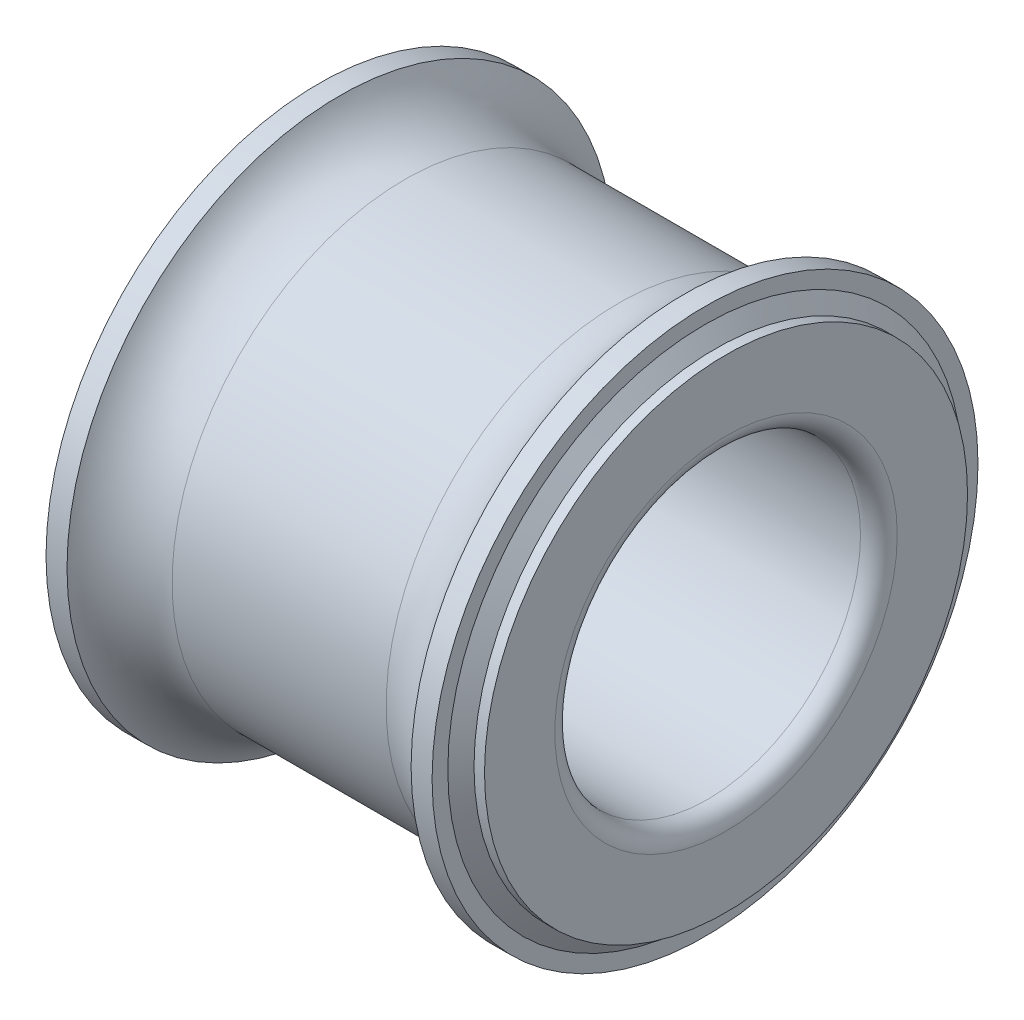
ISO-10303-21;
HEADER;
FILE_DESCRIPTION(('STEP AP214'),'2;1');
FILE_NAME('part.step','',(''),(''),'','','');
FILE_SCHEMA(('AUTOMOTIVE_DESIGN { 1 0 10303 214 1 1 1 1 }'));
ENDSEC;
DATA;
#1=APPLICATION_CONTEXT('core data for automotive mechanical design processes');
#2=APPLICATION_PROTOCOL_DEFINITION('international standard','automotive_design',2000,#1);
#3=PRODUCT_CONTEXT('',#1,'mechanical');
#4=PRODUCT('Part','Part','',(#3));
#5=PRODUCT_RELATED_PRODUCT_CATEGORY('part','',(#4));
#6=PRODUCT_DEFINITION_FORMATION('','',#4);
#7=PRODUCT_DEFINITION_CONTEXT('part definition',#1,'design');
#8=PRODUCT_DEFINITION('design','',#6,#7);
#9=PRODUCT_DEFINITION_SHAPE('','',#8);
#10=(LENGTH_UNIT() NAMED_UNIT(*) SI_UNIT(.MILLI.,.METRE.));
#11=(NAMED_UNIT(*) PLANE_ANGLE_UNIT() SI_UNIT($,.RADIAN.));
#12=(NAMED_UNIT(*) SI_UNIT($,.STERADIAN.) SOLID_ANGLE_UNIT());
#13=UNCERTAINTY_MEASURE_WITH_UNIT(LENGTH_MEASURE(1.E-05),#10,'distance_accuracy_value','');
#14=(GEOMETRIC_REPRESENTATION_CONTEXT(3) GLOBAL_UNCERTAINTY_ASSIGNED_CONTEXT((#13)) GLOBAL_UNIT_ASSIGNED_CONTEXT((#10,
#11,#12)) REPRESENTATION_CONTEXT('',''));
#15=CARTESIAN_POINT('',(0.,0.,0.));
#16=DIRECTION('',(0.,0.,1.));
#17=DIRECTION('',(1.,0.,0.));
#18=AXIS2_PLACEMENT_3D('',#15,#16,#17);
#19=CARTESIAN_POINT('',(13.4,0.,0.));
#20=DIRECTION('',(1.,0.,0.));
#21=DIRECTION('',(0.,0.,-1.));
#22=AXIS2_PLACEMENT_3D('',#19,#20,#21);
#23=CYLINDRICAL_SURFACE('',#22,8.928);
#24=CARTESIAN_POINT('',(12.627143624676,0.,0.));
#25=DIRECTION('',(1.,0.,0.));
#26=DIRECTION('',(0.,0.,-1.));
#27=AXIS2_PLACEMENT_3D('',#24,#25,#26);
#28=CIRCLE('',#27,8.928);
#29=CARTESIAN_POINT('',(12.627143624676,0.,-8.928));
#30=VERTEX_POINT('',#29);
#31=EDGE_CURVE('E44',#30,#30,#28,.T.);
#32=ORIENTED_EDGE('',*,*,#31,.T.);
#33=EDGE_LOOP('',(#32));
#34=FACE_BOUND('',#33,.T.);
#35=CARTESIAN_POINT('',(13.313571812338,0.,0.));
#36=DIRECTION('',(-1.,0.,0.));
#37=DIRECTION('',(0.,0.,1.));
#38=AXIS2_PLACEMENT_3D('',#35,#36,#37);
#39=CIRCLE('',#38,8.928);
#40=CARTESIAN_POINT('',(13.313571812338,0.,8.928));
#41=VERTEX_POINT('',#40);
#42=EDGE_CURVE('E73',#41,#41,#39,.T.);
#43=ORIENTED_EDGE('',*,*,#42,.T.);
#44=EDGE_LOOP('',(#43));
#45=FACE_BOUND('',#44,.T.);
#46=ADVANCED_FACE('F29',(#34,#45),#23,.T.);
#47=CARTESIAN_POINT('',(13.4,0.,0.));
#48=DIRECTION('',(1.,0.,0.));
#49=DIRECTION('',(0.,0.,-1.));
#50=AXIS2_PLACEMENT_3D('',#47,#48,#49);
#51=CYLINDRICAL_SURFACE('',#50,8.928);
#52=CARTESIAN_POINT('',(1.3728563753239,0.,0.));
#53=DIRECTION('',(1.,0.,0.));
#54=DIRECTION('',(0.,0.,-1.));
#55=AXIS2_PLACEMENT_3D('',#52,#53,#54);
#56=CIRCLE('',#55,8.928);
#57=CARTESIAN_POINT('',(1.3728563753239,0.,-8.928));
#58=VERTEX_POINT('',#57);
#59=EDGE_CURVE('E55',#58,#58,#56,.T.);
#60=ORIENTED_EDGE('',*,*,#59,.F.);
#61=EDGE_LOOP('',(#60));
#62=FACE_BOUND('',#61,.T.);
#63=CARTESIAN_POINT('',(0.68642818766197,0.,0.));
#64=DIRECTION('',(-1.,0.,0.));
#65=DIRECTION('',(0.,0.,1.));
#66=AXIS2_PLACEMENT_3D('',#63,#64,#65);
#67=CIRCLE('',#66,8.928);
#68=CARTESIAN_POINT('',(0.68642818766197,0.,8.928));
#69=VERTEX_POINT('',#68);
#70=EDGE_CURVE('E70',#69,#69,#67,.T.);
#71=ORIENTED_EDGE('',*,*,#70,.F.);
#72=EDGE_LOOP('',(#71));
#73=FACE_BOUND('',#72,.T.);
#74=ADVANCED_FACE('F104',(#62,#73),#51,.T.);
#75=CARTESIAN_POINT('',(10.4999999999993,0.,0.));
#76=DIRECTION('',(1.,0.,0.));
#77=DIRECTION('',(0.,0.,-1.));
#78=AXIS2_PLACEMENT_3D('',#75,#76,#77);
#79=TOROIDAL_SURFACE('',#78,10.0000000000011,2.38200000000109);
#80=CARTESIAN_POINT('',(10.5,0.,0.));
#81=DIRECTION('',(1.,0.,0.));
#82=DIRECTION('',(0.,0.,-1.));
#83=AXIS2_PLACEMENT_3D('',#80,#81,#82);
#84=CIRCLE('',#83,7.618);
#85=CARTESIAN_POINT('',(10.5,0.,-7.618));
#86=VERTEX_POINT('',#85);
#87=EDGE_CURVE('E49',#86,#86,#84,.T.);
#88=ORIENTED_EDGE('',*,*,#87,.T.);
#89=EDGE_LOOP('',(#88));
#90=FACE_BOUND('',#89,.T.);
#91=ORIENTED_EDGE('',*,*,#31,.F.);
#92=EDGE_LOOP('',(#91));
#93=FACE_BOUND('',#92,.T.);
#94=ADVANCED_FACE('F109',(#90,#93),#79,.F.);
#95=CARTESIAN_POINT('',(13.4,0.,0.));
#96=DIRECTION('',(1.,0.,0.));
#97=DIRECTION('',(0.,0.,-1.));
#98=AXIS2_PLACEMENT_3D('',#95,#96,#97);
#99=CYLINDRICAL_SURFACE('',#98,7.618);
#100=CARTESIAN_POINT('',(3.5,0.,0.));
#101=DIRECTION('',(1.,0.,0.));
#102=DIRECTION('',(0.,0.,-1.));
#103=AXIS2_PLACEMENT_3D('',#100,#101,#102);
#104=CIRCLE('',#103,7.618);
#105=CARTESIAN_POINT('',(3.5,0.,-7.618));
#106=VERTEX_POINT('',#105);
#107=EDGE_CURVE('E52',#106,#106,#104,.T.);
#108=ORIENTED_EDGE('',*,*,#107,.T.);
#109=EDGE_LOOP('',(#108));
#110=FACE_BOUND('',#109,.T.);
#111=ORIENTED_EDGE('',*,*,#87,.F.);
#112=EDGE_LOOP('',(#111));
#113=FACE_BOUND('',#112,.T.);
#114=ADVANCED_FACE('F116',(#110,#113),#99,.T.);
#115=CARTESIAN_POINT('',(3.50000000000006,0.,0.));
#116=DIRECTION('',(1.,0.,0.));
#117=DIRECTION('',(0.,0.,-1.));
#118=AXIS2_PLACEMENT_3D('',#115,#116,#117);
#119=TOROIDAL_SURFACE('',#118,10.0000000000002,2.38200000000017);
#120=ORIENTED_EDGE('',*,*,#59,.T.);
#121=EDGE_LOOP('',(#120));
#122=FACE_BOUND('',#121,.T.);
#123=ORIENTED_EDGE('',*,*,#107,.F.);
#124=EDGE_LOOP('',(#123));
#125=FACE_BOUND('',#124,.T.);
#126=ADVANCED_FACE('F120',(#122,#125),#119,.F.);
#127=CARTESIAN_POINT('',(0.68642818766197,8.414,0.));
#128=DIRECTION('',(-1.,0.,0.));
#129=DIRECTION('',(0.,0.,1.));
#130=AXIS2_PLACEMENT_3D('',#127,#128,#129);
#131=PLANE('',#130);
#132=ORIENTED_EDGE('',*,*,#70,.T.);
#133=EDGE_LOOP('',(#132));
#134=FACE_BOUND('',#133,.T.);
#135=CARTESIAN_POINT('',(0.68642818766197,0.,0.));
#136=DIRECTION('',(-1.,0.,0.));
#137=DIRECTION('',(0.,0.,1.));
#138=AXIS2_PLACEMENT_3D('',#135,#136,#137);
#139=CIRCLE('',#138,8.414);
#140=CARTESIAN_POINT('',(0.68642818766197,0.,8.414));
#141=VERTEX_POINT('',#140);
#142=EDGE_CURVE('E67',#141,#141,#139,.T.);
#143=ORIENTED_EDGE('',*,*,#142,.F.);
#144=EDGE_LOOP('',(#143));
#145=FACE_BOUND('',#144,.T.);
#146=ADVANCED_FACE('F123',(#134,#145),#131,.T.);
#147=CARTESIAN_POINT('',(0.34321409383099,0.,0.));
#148=DIRECTION('',(1.,0.,0.));
#149=DIRECTION('',(0.,0.,-1.));
#150=AXIS2_PLACEMENT_3D('',#147,#148,#149);
#151=CONICAL_SURFACE('',#150,7.9,0.982056754829537);
#152=ORIENTED_EDGE('',*,*,#142,.T.);
#153=EDGE_LOOP('',(#152));
#154=FACE_BOUND('',#153,.T.);
#155=CARTESIAN_POINT('',(0.34321409383099,0.,0.));
#156=DIRECTION('',(-1.,0.,0.));
#157=DIRECTION('',(0.,0.,1.));
#158=AXIS2_PLACEMENT_3D('',#155,#156,#157);
#159=CIRCLE('',#158,7.9);
#160=CARTESIAN_POINT('',(0.34321409383099,0.,7.9));
#161=VERTEX_POINT('',#160);
#162=EDGE_CURVE('E64',#161,#161,#159,.T.);
#163=ORIENTED_EDGE('',*,*,#162,.F.);
#164=EDGE_LOOP('',(#163));
#165=FACE_BOUND('',#164,.T.);
#166=ADVANCED_FACE('F134',(#154,#165),#151,.T.);
#167=CARTESIAN_POINT('',(14.,0.,0.));
#168=DIRECTION('',(-1.,0.,0.));
#169=DIRECTION('',(0.,0.,1.));
#170=AXIS2_PLACEMENT_3D('',#167,#168,#169);
#171=CYLINDRICAL_SURFACE('',#170,7.9);
#172=ORIENTED_EDGE('',*,*,#162,.T.);
#173=EDGE_LOOP('',(#172));
#174=FACE_BOUND('',#173,.T.);
#175=CARTESIAN_POINT('',(0.,0.,0.));
#176=DIRECTION('',(-1.,0.,0.));
#177=DIRECTION('',(0.,0.,1.));
#178=AXIS2_PLACEMENT_3D('',#175,#176,#177);
#179=CIRCLE('',#178,7.9);
#180=CARTESIAN_POINT('',(0.,0.,7.9));
#181=VERTEX_POINT('',#180);
#182=EDGE_CURVE('E61',#181,#181,#179,.T.);
#183=ORIENTED_EDGE('',*,*,#182,.F.);
#184=EDGE_LOOP('',(#183));
#185=FACE_BOUND('',#184,.T.);
#186=ADVANCED_FACE('F130',(#174,#185),#171,.T.);
#187=CARTESIAN_POINT('',(13.313571812338,8.928,0.));
#188=DIRECTION('',(1.,0.,0.));
#189=DIRECTION('',(0.,0.,-1.));
#190=AXIS2_PLACEMENT_3D('',#187,#188,#189);
#191=PLANE('',#190);
#192=CARTESIAN_POINT('',(13.313571812338,0.,0.));
#193=DIRECTION('',(-1.,0.,0.));
#194=DIRECTION('',(0.,0.,1.));
#195=AXIS2_PLACEMENT_3D('',#192,#193,#194);
#196=CIRCLE('',#195,8.414);
#197=CARTESIAN_POINT('',(13.313571812338,0.,8.414));
#198=VERTEX_POINT('',#197);
#199=EDGE_CURVE('E76',#198,#198,#196,.T.);
#200=ORIENTED_EDGE('',*,*,#199,.T.);
#201=EDGE_LOOP('',(#200));
#202=FACE_BOUND('',#201,.T.);
#203=ORIENTED_EDGE('',*,*,#42,.F.);
#204=EDGE_LOOP('',(#203));
#205=FACE_BOUND('',#204,.T.);
#206=ADVANCED_FACE('F133',(#202,#205),#191,.T.);
#207=CARTESIAN_POINT('',(13.313571812338,0.,0.));
#208=DIRECTION('',(-1.,0.,0.));
#209=DIRECTION('',(0.,0.,1.));
#210=AXIS2_PLACEMENT_3D('',#207,#208,#209);
#211=CONICAL_SURFACE('',#210,8.414,0.982056754829511);
#212=CARTESIAN_POINT('',(13.656785906169,0.,0.));
#213=DIRECTION('',(-1.,0.,0.));
#214=DIRECTION('',(0.,0.,1.));
#215=AXIS2_PLACEMENT_3D('',#212,#213,#214);
#216=CIRCLE('',#215,7.9);
#217=CARTESIAN_POINT('',(13.656785906169,0.,7.9));
#218=VERTEX_POINT('',#217);
#219=EDGE_CURVE('E79',#218,#218,#216,.T.);
#220=ORIENTED_EDGE('',*,*,#219,.T.);
#221=EDGE_LOOP('',(#220));
#222=FACE_BOUND('',#221,.T.);
#223=ORIENTED_EDGE('',*,*,#199,.F.);
#224=EDGE_LOOP('',(#223));
#225=FACE_BOUND('',#224,.T.);
#226=ADVANCED_FACE('F144',(#222,#225),#211,.T.);
#227=CARTESIAN_POINT('',(14.,0.,0.));
#228=DIRECTION('',(-1.,0.,0.));
#229=DIRECTION('',(0.,0.,1.));
#230=AXIS2_PLACEMENT_3D('',#227,#228,#229);
#231=CYLINDRICAL_SURFACE('',#230,7.9);
#232=CARTESIAN_POINT('',(14.,0.,0.));
#233=DIRECTION('',(-1.,0.,0.));
#234=DIRECTION('',(0.,0.,1.));
#235=AXIS2_PLACEMENT_3D('',#232,#233,#234);
#236=CIRCLE('',#235,7.9);
#237=CARTESIAN_POINT('',(14.,0.,7.9));
#238=VERTEX_POINT('',#237);
#239=EDGE_CURVE('E82',#238,#238,#236,.T.);
#240=ORIENTED_EDGE('',*,*,#239,.T.);
#241=EDGE_LOOP('',(#240));
#242=FACE_BOUND('',#241,.T.);
#243=ORIENTED_EDGE('',*,*,#219,.F.);
#244=EDGE_LOOP('',(#243));
#245=FACE_BOUND('',#244,.T.);
#246=ADVANCED_FACE('F86',(#242,#245),#231,.T.);
#247=CARTESIAN_POINT('',(13.4000000000001,0.,0.));
#248=DIRECTION('',(1.,0.,0.));
#249=DIRECTION('',(0.,0.,-1.));
#250=AXIS2_PLACEMENT_3D('',#247,#248,#249);
#251=TOROIDAL_SURFACE('',#250,5.59999999999993,0.599999999999929);
#252=CARTESIAN_POINT('',(14.,0.,0.));
#253=DIRECTION('',(1.,0.,0.));
#254=DIRECTION('',(0.,0.,-1.));
#255=AXIS2_PLACEMENT_3D('',#252,#253,#254);
#256=CIRCLE('',#255,5.6);
#257=CARTESIAN_POINT('',(14.,0.,-5.6));
#258=VERTEX_POINT('',#257);
#259=EDGE_CURVE('E40',#258,#258,#256,.T.);
#260=ORIENTED_EDGE('',*,*,#259,.T.);
#261=EDGE_LOOP('',(#260));
#262=FACE_BOUND('',#261,.T.);
#263=CARTESIAN_POINT('',(13.4,0.,0.));
#264=DIRECTION('',(1.,0.,0.));
#265=DIRECTION('',(0.,0.,-1.));
#266=AXIS2_PLACEMENT_3D('',#263,#264,#265);
#267=CIRCLE('',#266,5.);
#268=CARTESIAN_POINT('',(13.4,0.,-5.));
#269=VERTEX_POINT('',#268);
#270=EDGE_CURVE('E36',#269,#269,#267,.T.);
#271=ORIENTED_EDGE('',*,*,#270,.F.);
#272=EDGE_LOOP('',(#271));
#273=FACE_BOUND('',#272,.T.);
#274=ADVANCED_FACE('F92',(#262,#273),#251,.T.);
#275=CARTESIAN_POINT('',(14.,5.6,0.));
#276=DIRECTION('',(1.,0.,0.));
#277=DIRECTION('',(0.,0.,-1.));
#278=AXIS2_PLACEMENT_3D('',#275,#276,#277);
#279=PLANE('',#278);
#280=ORIENTED_EDGE('',*,*,#259,.F.);
#281=EDGE_LOOP('',(#280));
#282=FACE_BOUND('',#281,.T.);
#283=ORIENTED_EDGE('',*,*,#239,.F.);
#284=EDGE_LOOP('',(#283));
#285=FACE_BOUND('',#284,.T.);
#286=ADVANCED_FACE('F89',(#282,#285),#279,.T.);
#287=CARTESIAN_POINT('',(13.4,0.,0.));
#288=DIRECTION('',(1.,0.,0.));
#289=DIRECTION('',(0.,0.,-1.));
#290=AXIS2_PLACEMENT_3D('',#287,#288,#289);
#291=CYLINDRICAL_SURFACE('',#290,5.);
#292=ORIENTED_EDGE('',*,*,#270,.T.);
#293=EDGE_LOOP('',(#292));
#294=FACE_BOUND('',#293,.T.);
#295=CARTESIAN_POINT('',(0.6,0.,0.));
#296=DIRECTION('',(1.,0.,0.));
#297=DIRECTION('',(0.,0.,-1.));
#298=AXIS2_PLACEMENT_3D('',#295,#296,#297);
#299=CIRCLE('',#298,5.);
#300=CARTESIAN_POINT('',(0.6,0.,-5.));
#301=VERTEX_POINT('',#300);
#302=EDGE_CURVE('E10',#301,#301,#299,.T.);
#303=ORIENTED_EDGE('',*,*,#302,.F.);
#304=EDGE_LOOP('',(#303));
#305=FACE_BOUND('',#304,.T.);
#306=ADVANCED_FACE('F91',(#294,#305),#291,.F.);
#307=CARTESIAN_POINT('',(0.600000000000047,0.,0.));
#308=DIRECTION('',(1.,0.,0.));
#309=DIRECTION('',(0.,0.,-1.));
#310=AXIS2_PLACEMENT_3D('',#307,#308,#309);
#311=TOROIDAL_SURFACE('',#310,5.60000000000005,0.600000000000047);
#312=ORIENTED_EDGE('',*,*,#302,.T.);
#313=EDGE_LOOP('',(#312));
#314=FACE_BOUND('',#313,.T.);
#315=CARTESIAN_POINT('',(0.,0.,0.));
#316=DIRECTION('',(1.,0.,0.));
#317=DIRECTION('',(0.,0.,-1.));
#318=AXIS2_PLACEMENT_3D('',#315,#316,#317);
#319=CIRCLE('',#318,5.6);
#320=CARTESIAN_POINT('',(0.,0.,-5.6));
#321=VERTEX_POINT('',#320);
#322=EDGE_CURVE('E58',#321,#321,#319,.T.);
#323=ORIENTED_EDGE('',*,*,#322,.F.);
#324=EDGE_LOOP('',(#323));
#325=FACE_BOUND('',#324,.T.);
#326=ADVANCED_FACE('F31',(#314,#325),#311,.T.);
#327=CARTESIAN_POINT('',(0.,8.728,0.));
#328=DIRECTION('',(-1.,0.,0.));
#329=DIRECTION('',(0.,0.,1.));
#330=AXIS2_PLACEMENT_3D('',#327,#328,#329);
#331=PLANE('',#330);
#332=ORIENTED_EDGE('',*,*,#322,.T.);
#333=EDGE_LOOP('',(#332));
#334=FACE_BOUND('',#333,.T.);
#335=ORIENTED_EDGE('',*,*,#182,.T.);
#336=EDGE_LOOP('',(#335));
#337=FACE_BOUND('',#336,.T.);
#338=ADVANCED_FACE('F126',(#334,#337),#331,.T.);
#339=CLOSED_SHELL('',(#46,#74,#94,#114,#126,#146,#166,#186,#206,#226,#246,#274,#286,#306,#326,#338));
#340=MANIFOLD_SOLID_BREP('B2',#339);
#341=ADVANCED_BREP_SHAPE_REPRESENTATION('',(#18,#340),#14);
#342=SHAPE_DEFINITION_REPRESENTATION(#9,#341);
ENDSEC;
END-ISO-10303-21;
